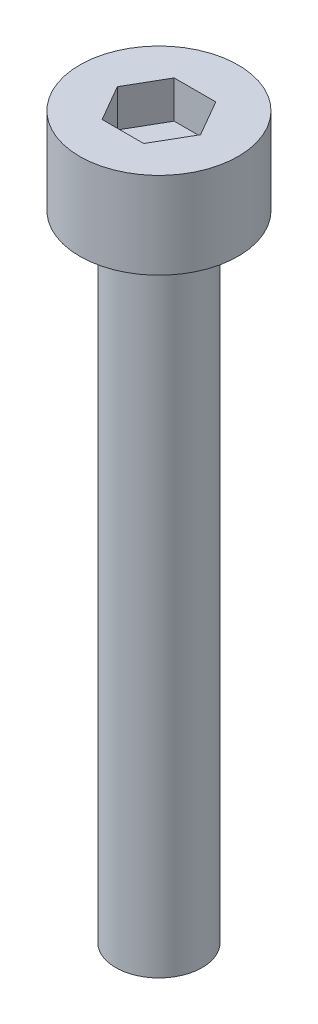
ISO-10303-21;
HEADER;
FILE_DESCRIPTION(('STEP AP214'),'2;1');
FILE_NAME('part.step','',(''),(''),'','','');
FILE_SCHEMA(('AUTOMOTIVE_DESIGN { 1 0 10303 214 1 1 1 1 }'));
ENDSEC;
DATA;
#1=APPLICATION_CONTEXT('core data for automotive mechanical design processes');
#2=APPLICATION_PROTOCOL_DEFINITION('international standard','automotive_design',2000,#1);
#3=PRODUCT_CONTEXT('',#1,'mechanical');
#4=PRODUCT('Part','Part','',(#3));
#5=PRODUCT_RELATED_PRODUCT_CATEGORY('part','',(#4));
#6=PRODUCT_DEFINITION_FORMATION('','',#4);
#7=PRODUCT_DEFINITION_CONTEXT('part definition',#1,'design');
#8=PRODUCT_DEFINITION('design','',#6,#7);
#9=PRODUCT_DEFINITION_SHAPE('','',#8);
#10=(LENGTH_UNIT() NAMED_UNIT(*) SI_UNIT(.MILLI.,.METRE.));
#11=(NAMED_UNIT(*) PLANE_ANGLE_UNIT() SI_UNIT($,.RADIAN.));
#12=(NAMED_UNIT(*) SI_UNIT($,.STERADIAN.) SOLID_ANGLE_UNIT());
#13=UNCERTAINTY_MEASURE_WITH_UNIT(LENGTH_MEASURE(1.E-05),#10,'distance_accuracy_value','');
#14=(GEOMETRIC_REPRESENTATION_CONTEXT(3) GLOBAL_UNCERTAINTY_ASSIGNED_CONTEXT((#13)) GLOBAL_UNIT_ASSIGNED_CONTEXT((#10,
#11,#12)) REPRESENTATION_CONTEXT('',''));
#15=CARTESIAN_POINT('',(0.,0.,0.));
#16=DIRECTION('',(0.,0.,1.));
#17=DIRECTION('',(1.,0.,0.));
#18=AXIS2_PLACEMENT_3D('',#15,#16,#17);
#19=CARTESIAN_POINT('',(0.,3.,0.));
#20=DIRECTION('',(0.,-1.,0.));
#21=DIRECTION('',(0.,0.,-1.));
#22=AXIS2_PLACEMENT_3D('',#19,#20,#21);
#23=CYLINDRICAL_SURFACE('',#22,2.75);
#24=CARTESIAN_POINT('',(0.,3.,0.));
#25=DIRECTION('',(0.,1.,0.));
#26=DIRECTION('',(0.,0.,1.));
#27=AXIS2_PLACEMENT_3D('',#24,#25,#26);
#28=CIRCLE('',#27,2.75);
#29=CARTESIAN_POINT('',(0.,3.,2.75));
#30=VERTEX_POINT('',#29);
#31=EDGE_CURVE('E45',#30,#30,#28,.T.);
#32=ORIENTED_EDGE('',*,*,#31,.F.);
#33=EDGE_LOOP('',(#32));
#34=FACE_BOUND('',#33,.T.);
#35=CARTESIAN_POINT('',(0.,0.,0.));
#36=DIRECTION('',(0.,1.,0.));
#37=DIRECTION('',(0.,0.,1.));
#38=AXIS2_PLACEMENT_3D('',#35,#36,#37);
#39=CIRCLE('',#38,2.75);
#40=CARTESIAN_POINT('',(0.,0.,2.75));
#41=VERTEX_POINT('',#40);
#42=EDGE_CURVE('E40',#41,#41,#39,.T.);
#43=ORIENTED_EDGE('',*,*,#42,.T.);
#44=EDGE_LOOP('',(#43));
#45=FACE_BOUND('',#44,.T.);
#46=ADVANCED_FACE('F37',(#34,#45),#23,.T.);
#47=CARTESIAN_POINT('',(0.,3.,0.));
#48=DIRECTION('',(0.,1.,0.));
#49=DIRECTION('',(0.,0.,1.));
#50=AXIS2_PLACEMENT_3D('',#47,#48,#49);
#51=PLANE('',#50);
#52=DIRECTION('',(0.5,0.,-0.866025403784439));
#53=VECTOR('',#52,1.);
#54=CARTESIAN_POINT('',(0.721687836487032,3.,1.25));
#55=LINE('',#54,#53);
#56=CARTESIAN_POINT('',(0.721687836487032,3.,1.25));
#57=VERTEX_POINT('',#56);
#58=CARTESIAN_POINT('',(1.44337567297406,3.,0.));
#59=VERTEX_POINT('',#58);
#60=EDGE_CURVE('E53',#57,#59,#55,.T.);
#61=ORIENTED_EDGE('',*,*,#60,.F.);
#62=DIRECTION('',(1.,0.,0.));
#63=VECTOR('',#62,1.);
#64=CARTESIAN_POINT('',(-0.721687836487033,3.,1.25));
#65=LINE('',#64,#63);
#66=CARTESIAN_POINT('',(-0.721687836487033,3.,1.25));
#67=VERTEX_POINT('',#66);
#68=EDGE_CURVE('E137',#67,#57,#65,.T.);
#69=ORIENTED_EDGE('',*,*,#68,.F.);
#70=DIRECTION('',(0.5,0.,0.866025403784439));
#71=VECTOR('',#70,1.);
#72=CARTESIAN_POINT('',(-1.44337567297407,3.,0.));
#73=LINE('',#72,#71);
#74=CARTESIAN_POINT('',(-1.44337567297407,3.,0.));
#75=VERTEX_POINT('',#74);
#76=EDGE_CURVE('E135',#75,#67,#73,.T.);
#77=ORIENTED_EDGE('',*,*,#76,.F.);
#78=DIRECTION('',(-0.5,0.,0.866025403784438));
#79=VECTOR('',#78,1.);
#80=CARTESIAN_POINT('',(-0.721687836487033,3.,-1.25));
#81=LINE('',#80,#79);
#82=CARTESIAN_POINT('',(-0.721687836487033,3.,-1.25));
#83=VERTEX_POINT('',#82);
#84=EDGE_CURVE('E101',#83,#75,#81,.T.);
#85=ORIENTED_EDGE('',*,*,#84,.F.);
#86=DIRECTION('',(-1.,0.,0.));
#87=VECTOR('',#86,1.);
#88=CARTESIAN_POINT('',(0.721687836487032,3.,-1.25));
#89=LINE('',#88,#87);
#90=CARTESIAN_POINT('',(0.721687836487032,3.,-1.25));
#91=VERTEX_POINT('',#90);
#92=EDGE_CURVE('E131',#91,#83,#89,.T.);
#93=ORIENTED_EDGE('',*,*,#92,.F.);
#94=DIRECTION('',(-0.5,0.,-0.866025403784439));
#95=VECTOR('',#94,1.);
#96=CARTESIAN_POINT('',(1.44337567297406,3.,0.));
#97=LINE('',#96,#95);
#98=EDGE_CURVE('E127',#59,#91,#97,.T.);
#99=ORIENTED_EDGE('',*,*,#98,.F.);
#100=EDGE_LOOP('',(#61,#69,#77,#85,#93,#99));
#101=FACE_BOUND('',#100,.T.);
#102=ORIENTED_EDGE('',*,*,#31,.T.);
#103=EDGE_LOOP('',(#102));
#104=FACE_BOUND('',#103,.T.);
#105=ADVANCED_FACE('F155',(#101,#104),#51,.T.);
#106=CARTESIAN_POINT('',(0.,0.,0.));
#107=DIRECTION('',(0.,1.,0.));
#108=DIRECTION('',(0.,0.,1.));
#109=AXIS2_PLACEMENT_3D('',#106,#107,#108);
#110=PLANE('',#109);
#111=CARTESIAN_POINT('',(0.,0.,0.));
#112=DIRECTION('',(0.,-1.,0.));
#113=DIRECTION('',(0.,0.,-1.));
#114=AXIS2_PLACEMENT_3D('',#111,#112,#113);
#115=CIRCLE('',#114,1.5);
#116=CARTESIAN_POINT('',(0.,0.,-1.5));
#117=VERTEX_POINT('',#116);
#118=EDGE_CURVE('E11',#117,#117,#115,.T.);
#119=ORIENTED_EDGE('',*,*,#118,.F.);
#120=EDGE_LOOP('',(#119));
#121=FACE_BOUND('',#120,.T.);
#122=ORIENTED_EDGE('',*,*,#42,.F.);
#123=EDGE_LOOP('',(#122));
#124=FACE_BOUND('',#123,.T.);
#125=ADVANCED_FACE('F152',(#121,#124),#110,.F.);
#126=CARTESIAN_POINT('',(0.721687836487032,1.7,1.25));
#127=DIRECTION('',(0.866025403784439,0.,0.5));
#128=DIRECTION('',(0.5,0.,-0.866025403784439));
#129=AXIS2_PLACEMENT_3D('',#126,#127,#128);
#130=PLANE('',#129);
#131=ORIENTED_EDGE('',*,*,#60,.T.);
#132=DIRECTION('',(0.,1.,0.));
#133=VECTOR('',#132,1.);
#134=CARTESIAN_POINT('',(1.44337567297406,1.7,0.));
#135=LINE('',#134,#133);
#136=CARTESIAN_POINT('',(1.44337567297406,1.7,0.));
#137=VERTEX_POINT('',#136);
#138=EDGE_CURVE('E83',#137,#59,#135,.T.);
#139=ORIENTED_EDGE('',*,*,#138,.F.);
#140=DIRECTION('',(0.5,0.,-0.866025403784439));
#141=VECTOR('',#140,1.);
#142=CARTESIAN_POINT('',(0.721687836487032,1.7,1.25));
#143=LINE('',#142,#141);
#144=CARTESIAN_POINT('',(0.721687836487032,1.7,1.25));
#145=VERTEX_POINT('',#144);
#146=EDGE_CURVE('E139',#145,#137,#143,.T.);
#147=ORIENTED_EDGE('',*,*,#146,.F.);
#148=DIRECTION('',(0.,1.,0.));
#149=VECTOR('',#148,1.);
#150=CARTESIAN_POINT('',(0.721687836487032,1.7,1.25));
#151=LINE('',#150,#149);
#152=EDGE_CURVE('E61',#145,#57,#151,.T.);
#153=ORIENTED_EDGE('',*,*,#152,.T.);
#154=EDGE_LOOP('',(#131,#139,#147,#153));
#155=FACE_BOUND('',#154,.T.);
#156=ADVANCED_FACE('F154',(#155),#130,.F.);
#157=CARTESIAN_POINT('',(-0.721687836487033,1.7,1.25));
#158=DIRECTION('',(0.,0.,1.));
#159=DIRECTION('',(1.,0.,0.));
#160=AXIS2_PLACEMENT_3D('',#157,#158,#159);
#161=PLANE('',#160);
#162=ORIENTED_EDGE('',*,*,#68,.T.);
#163=ORIENTED_EDGE('',*,*,#152,.F.);
#164=DIRECTION('',(1.,0.,0.));
#165=VECTOR('',#164,1.);
#166=CARTESIAN_POINT('',(-0.721687836487033,1.7,1.25));
#167=LINE('',#166,#165);
#168=CARTESIAN_POINT('',(-0.721687836487033,1.7,1.25));
#169=VERTEX_POINT('',#168);
#170=EDGE_CURVE('E113',#169,#145,#167,.T.);
#171=ORIENTED_EDGE('',*,*,#170,.F.);
#172=DIRECTION('',(0.,1.,0.));
#173=VECTOR('',#172,1.);
#174=CARTESIAN_POINT('',(-0.721687836487033,1.7,1.25));
#175=LINE('',#174,#173);
#176=EDGE_CURVE('E105',#169,#67,#175,.T.);
#177=ORIENTED_EDGE('',*,*,#176,.T.);
#178=EDGE_LOOP('',(#162,#163,#171,#177));
#179=FACE_BOUND('',#178,.T.);
#180=ADVANCED_FACE('F161',(#179),#161,.F.);
#181=CARTESIAN_POINT('',(-1.44337567297407,1.7,0.));
#182=DIRECTION('',(-0.866025403784439,0.,0.5));
#183=DIRECTION('',(0.5,0.,0.866025403784439));
#184=AXIS2_PLACEMENT_3D('',#181,#182,#183);
#185=PLANE('',#184);
#186=ORIENTED_EDGE('',*,*,#76,.T.);
#187=ORIENTED_EDGE('',*,*,#176,.F.);
#188=DIRECTION('',(0.5,0.,0.866025403784439));
#189=VECTOR('',#188,1.);
#190=CARTESIAN_POINT('',(-1.44337567297407,1.7,0.));
#191=LINE('',#190,#189);
#192=CARTESIAN_POINT('',(-1.44337567297407,1.7,0.));
#193=VERTEX_POINT('',#192);
#194=EDGE_CURVE('E109',#193,#169,#191,.T.);
#195=ORIENTED_EDGE('',*,*,#194,.F.);
#196=DIRECTION('',(0.,1.,0.));
#197=VECTOR('',#196,1.);
#198=CARTESIAN_POINT('',(-1.44337567297407,1.7,0.));
#199=LINE('',#198,#197);
#200=EDGE_CURVE('E94',#193,#75,#199,.T.);
#201=ORIENTED_EDGE('',*,*,#200,.T.);
#202=EDGE_LOOP('',(#186,#187,#195,#201));
#203=FACE_BOUND('',#202,.T.);
#204=ADVANCED_FACE('F110',(#203),#185,.F.);
#205=CARTESIAN_POINT('',(-0.721687836487033,1.7,-1.25));
#206=DIRECTION('',(-0.866025403784439,0.,-0.5));
#207=DIRECTION('',(-0.5,0.,0.866025403784439));
#208=AXIS2_PLACEMENT_3D('',#205,#206,#207);
#209=PLANE('',#208);
#210=ORIENTED_EDGE('',*,*,#84,.T.);
#211=ORIENTED_EDGE('',*,*,#200,.F.);
#212=DIRECTION('',(-0.5,0.,0.866025403784438));
#213=VECTOR('',#212,1.);
#214=CARTESIAN_POINT('',(-0.721687836487033,1.7,-1.25));
#215=LINE('',#214,#213);
#216=CARTESIAN_POINT('',(-0.721687836487033,1.7,-1.25));
#217=VERTEX_POINT('',#216);
#218=EDGE_CURVE('E98',#217,#193,#215,.T.);
#219=ORIENTED_EDGE('',*,*,#218,.F.);
#220=DIRECTION('',(0.,1.,0.));
#221=VECTOR('',#220,1.);
#222=CARTESIAN_POINT('',(-0.721687836487033,1.7,-1.25));
#223=LINE('',#222,#221);
#224=EDGE_CURVE('E106',#217,#83,#223,.T.);
#225=ORIENTED_EDGE('',*,*,#224,.T.);
#226=EDGE_LOOP('',(#210,#211,#219,#225));
#227=FACE_BOUND('',#226,.T.);
#228=ADVANCED_FACE('F96',(#227),#209,.F.);
#229=CARTESIAN_POINT('',(0.721687836487032,1.7,-1.25));
#230=DIRECTION('',(0.,0.,-1.));
#231=DIRECTION('',(-1.,0.,0.));
#232=AXIS2_PLACEMENT_3D('',#229,#230,#231);
#233=PLANE('',#232);
#234=ORIENTED_EDGE('',*,*,#92,.T.);
#235=ORIENTED_EDGE('',*,*,#224,.F.);
#236=DIRECTION('',(-1.,0.,0.));
#237=VECTOR('',#236,1.);
#238=CARTESIAN_POINT('',(0.721687836487032,1.7,-1.25));
#239=LINE('',#238,#237);
#240=CARTESIAN_POINT('',(0.721687836487032,1.7,-1.25));
#241=VERTEX_POINT('',#240);
#242=EDGE_CURVE('E119',#241,#217,#239,.T.);
#243=ORIENTED_EDGE('',*,*,#242,.F.);
#244=DIRECTION('',(0.,1.,0.));
#245=VECTOR('',#244,1.);
#246=CARTESIAN_POINT('',(0.721687836487032,1.7,-1.25));
#247=LINE('',#246,#245);
#248=EDGE_CURVE('E143',#241,#91,#247,.T.);
#249=ORIENTED_EDGE('',*,*,#248,.T.);
#250=EDGE_LOOP('',(#234,#235,#243,#249));
#251=FACE_BOUND('',#250,.T.);
#252=ADVANCED_FACE('F206',(#251),#233,.F.);
#253=CARTESIAN_POINT('',(1.44337567297406,1.7,0.));
#254=DIRECTION('',(0.866025403784439,0.,-0.5));
#255=DIRECTION('',(-0.5,0.,-0.866025403784439));
#256=AXIS2_PLACEMENT_3D('',#253,#254,#255);
#257=PLANE('',#256);
#258=ORIENTED_EDGE('',*,*,#98,.T.);
#259=ORIENTED_EDGE('',*,*,#248,.F.);
#260=DIRECTION('',(-0.5,0.,-0.866025403784439));
#261=VECTOR('',#260,1.);
#262=CARTESIAN_POINT('',(1.44337567297406,1.7,0.));
#263=LINE('',#262,#261);
#264=EDGE_CURVE('E121',#137,#241,#263,.T.);
#265=ORIENTED_EDGE('',*,*,#264,.F.);
#266=ORIENTED_EDGE('',*,*,#138,.T.);
#267=EDGE_LOOP('',(#258,#259,#265,#266));
#268=FACE_BOUND('',#267,.T.);
#269=ADVANCED_FACE('F215',(#268),#257,.F.);
#270=CARTESIAN_POINT('',(0.,1.7,0.));
#271=DIRECTION('',(0.,1.,0.));
#272=DIRECTION('',(0.,0.,1.));
#273=AXIS2_PLACEMENT_3D('',#270,#271,#272);
#274=PLANE('',#273);
#275=ORIENTED_EDGE('',*,*,#146,.T.);
#276=ORIENTED_EDGE('',*,*,#264,.T.);
#277=ORIENTED_EDGE('',*,*,#242,.T.);
#278=ORIENTED_EDGE('',*,*,#218,.T.);
#279=ORIENTED_EDGE('',*,*,#194,.T.);
#280=ORIENTED_EDGE('',*,*,#170,.T.);
#281=EDGE_LOOP('',(#275,#276,#277,#278,#279,#280));
#282=FACE_BOUND('',#281,.T.);
#283=ADVANCED_FACE('F116',(#282),#274,.T.);
#284=CARTESIAN_POINT('',(0.,-22.,0.));
#285=DIRECTION('',(0.,1.,0.));
#286=DIRECTION('',(0.,0.,1.));
#287=AXIS2_PLACEMENT_3D('',#284,#285,#286);
#288=CYLINDRICAL_SURFACE('',#287,1.5);
#289=CARTESIAN_POINT('',(0.,-22.,0.));
#290=DIRECTION('',(0.,-1.,0.));
#291=DIRECTION('',(0.,0.,-1.));
#292=AXIS2_PLACEMENT_3D('',#289,#290,#291);
#293=CIRCLE('',#292,1.5);
#294=CARTESIAN_POINT('',(0.,-22.,-1.5));
#295=VERTEX_POINT('',#294);
#296=EDGE_CURVE('E128',#295,#295,#293,.T.);
#297=ORIENTED_EDGE('',*,*,#296,.F.);
#298=EDGE_LOOP('',(#297));
#299=FACE_BOUND('',#298,.T.);
#300=ORIENTED_EDGE('',*,*,#118,.T.);
#301=EDGE_LOOP('',(#300));
#302=FACE_BOUND('',#301,.T.);
#303=ADVANCED_FACE('F233',(#299,#302),#288,.T.);
#304=CARTESIAN_POINT('',(0.,-22.,0.));
#305=DIRECTION('',(0.,-1.,0.));
#306=DIRECTION('',(0.,0.,-1.));
#307=AXIS2_PLACEMENT_3D('',#304,#305,#306);
#308=PLANE('',#307);
#309=ORIENTED_EDGE('',*,*,#296,.T.);
#310=EDGE_LOOP('',(#309));
#311=FACE_BOUND('',#310,.T.);
#312=ADVANCED_FACE('F247',(#311),#308,.T.);
#313=CLOSED_SHELL('',(#46,#105,#125,#156,#180,#204,#228,#252,#269,#283,#303,#312));
#314=MANIFOLD_SOLID_BREP('B2',#313);
#315=ADVANCED_BREP_SHAPE_REPRESENTATION('',(#18,#314),#14);
#316=SHAPE_DEFINITION_REPRESENTATION(#9,#315);
ENDSEC;
END-ISO-10303-21;
